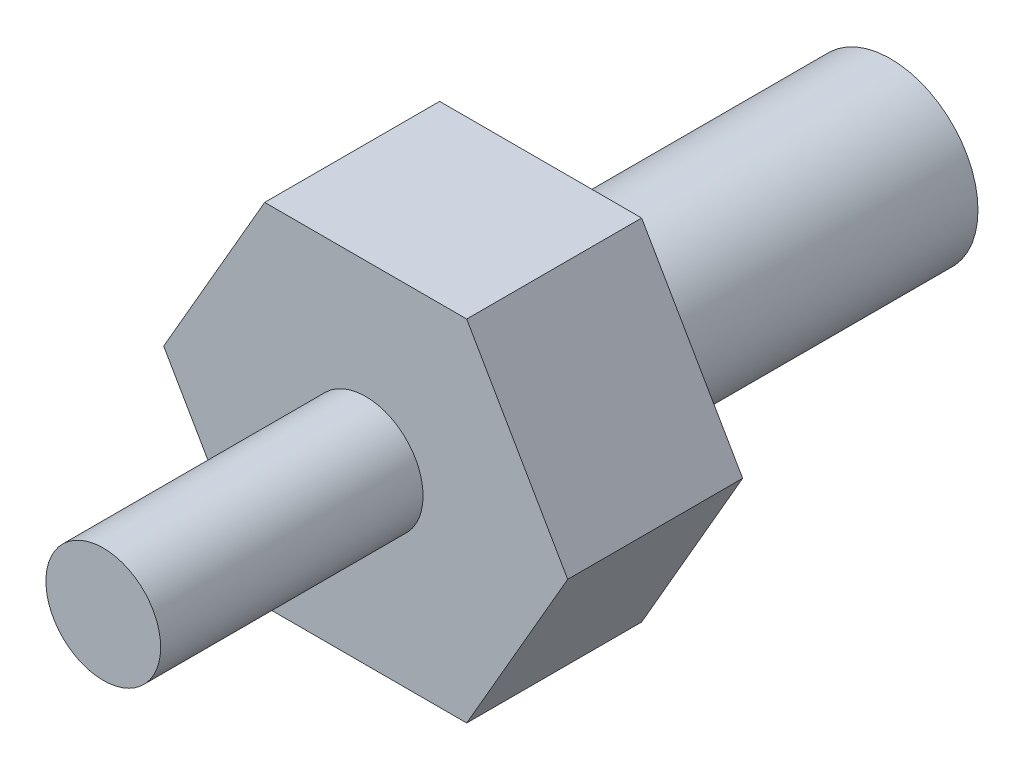
ISO-10303-21;
HEADER;
FILE_DESCRIPTION(('STEP AP214'),'2;1');
FILE_NAME('part.step','',(''),(''),'','','');
FILE_SCHEMA(('AUTOMOTIVE_DESIGN { 1 0 10303 214 1 1 1 1 }'));
ENDSEC;
DATA;
#1=APPLICATION_CONTEXT('core data for automotive mechanical design processes');
#2=APPLICATION_PROTOCOL_DEFINITION('international standard','automotive_design',2000,#1);
#3=PRODUCT_CONTEXT('',#1,'mechanical');
#4=PRODUCT('Part','Part','',(#3));
#5=PRODUCT_RELATED_PRODUCT_CATEGORY('part','',(#4));
#6=PRODUCT_DEFINITION_FORMATION('','',#4);
#7=PRODUCT_DEFINITION_CONTEXT('part definition',#1,'design');
#8=PRODUCT_DEFINITION('design','',#6,#7);
#9=PRODUCT_DEFINITION_SHAPE('','',#8);
#10=(LENGTH_UNIT() NAMED_UNIT(*) SI_UNIT(.MILLI.,.METRE.));
#11=(NAMED_UNIT(*) PLANE_ANGLE_UNIT() SI_UNIT($,.RADIAN.));
#12=(NAMED_UNIT(*) SI_UNIT($,.STERADIAN.) SOLID_ANGLE_UNIT());
#13=UNCERTAINTY_MEASURE_WITH_UNIT(LENGTH_MEASURE(1.E-05),#10,'distance_accuracy_value','');
#14=(GEOMETRIC_REPRESENTATION_CONTEXT(3) GLOBAL_UNCERTAINTY_ASSIGNED_CONTEXT((#13)) GLOBAL_UNIT_ASSIGNED_CONTEXT((#10,
#11,#12)) REPRESENTATION_CONTEXT('',''));
#15=CARTESIAN_POINT('',(0.,0.,0.));
#16=DIRECTION('',(0.,0.,1.));
#17=DIRECTION('',(1.,0.,0.));
#18=AXIS2_PLACEMENT_3D('',#15,#16,#17);
#19=CARTESIAN_POINT('',(0.,0.,12.7));
#20=DIRECTION('',(0.,0.,-1.));
#21=DIRECTION('',(-1.,0.,0.));
#22=AXIS2_PLACEMENT_3D('',#19,#20,#21);
#23=CYLINDRICAL_SURFACE('',#22,3.175);
#24=CARTESIAN_POINT('',(0.,0.,12.7));
#25=DIRECTION('',(0.,0.,1.));
#26=DIRECTION('',(1.,0.,0.));
#27=AXIS2_PLACEMENT_3D('',#24,#25,#26);
#28=CIRCLE('',#27,3.175);
#29=CARTESIAN_POINT('',(3.175,0.,12.7));
#30=VERTEX_POINT('',#29);
#31=EDGE_CURVE('E45',#30,#30,#28,.T.);
#32=ORIENTED_EDGE('',*,*,#31,.F.);
#33=EDGE_LOOP('',(#32));
#34=FACE_BOUND('',#33,.T.);
#35=CARTESIAN_POINT('',(0.,0.,0.));
#36=DIRECTION('',(0.,0.,1.));
#37=DIRECTION('',(1.,0.,0.));
#38=AXIS2_PLACEMENT_3D('',#35,#36,#37);
#39=CIRCLE('',#38,3.175);
#40=CARTESIAN_POINT('',(3.175,0.,0.));
#41=VERTEX_POINT('',#40);
#42=EDGE_CURVE('E39',#41,#41,#39,.T.);
#43=ORIENTED_EDGE('',*,*,#42,.T.);
#44=EDGE_LOOP('',(#43));
#45=FACE_BOUND('',#44,.T.);
#46=ADVANCED_FACE('F36',(#34,#45),#23,.T.);
#47=CARTESIAN_POINT('',(0.,0.,0.));
#48=DIRECTION('',(0.,0.,1.));
#49=DIRECTION('',(1.,0.,0.));
#50=AXIS2_PLACEMENT_3D('',#47,#48,#49);
#51=PLANE('',#50);
#52=ORIENTED_EDGE('',*,*,#42,.F.);
#53=EDGE_LOOP('',(#52));
#54=FACE_BOUND('',#53,.T.);
#55=ADVANCED_FACE('F149',(#54),#51,.F.);
#56=CARTESIAN_POINT('',(-3.66617420935412,-6.35,19.05));
#57=DIRECTION('',(0.,1.,0.));
#58=DIRECTION('',(0.,0.,1.));
#59=AXIS2_PLACEMENT_3D('',#56,#57,#58);
#60=PLANE('',#59);
#61=DIRECTION('',(1.,0.,0.));
#62=VECTOR('',#61,1.);
#63=CARTESIAN_POINT('',(-3.66617420935412,-6.35,12.7));
#64=LINE('',#63,#62);
#65=CARTESIAN_POINT('',(-3.66617420935412,-6.35,12.7));
#66=VERTEX_POINT('',#65);
#67=CARTESIAN_POINT('',(3.66617420935412,-6.35,12.7));
#68=VERTEX_POINT('',#67);
#69=EDGE_CURVE('E123',#66,#68,#64,.T.);
#70=ORIENTED_EDGE('',*,*,#69,.T.);
#71=DIRECTION('',(0.,0.,-1.));
#72=VECTOR('',#71,1.);
#73=CARTESIAN_POINT('',(3.66617420935412,-6.35,19.05));
#74=LINE('',#73,#72);
#75=CARTESIAN_POINT('',(3.66617420935412,-6.35,19.05));
#76=VERTEX_POINT('',#75);
#77=EDGE_CURVE('E141',#76,#68,#74,.T.);
#78=ORIENTED_EDGE('',*,*,#77,.F.);
#79=DIRECTION('',(1.,0.,0.));
#80=VECTOR('',#79,1.);
#81=CARTESIAN_POINT('',(-3.66617420935412,-6.35,19.05));
#82=LINE('',#81,#80);
#83=CARTESIAN_POINT('',(-3.66617420935412,-6.35,19.05));
#84=VERTEX_POINT('',#83);
#85=EDGE_CURVE('E134',#84,#76,#82,.T.);
#86=ORIENTED_EDGE('',*,*,#85,.F.);
#87=DIRECTION('',(0.,0.,-1.));
#88=VECTOR('',#87,1.);
#89=CARTESIAN_POINT('',(-3.66617420935412,-6.35,19.05));
#90=LINE('',#89,#88);
#91=EDGE_CURVE('E119',#84,#66,#90,.T.);
#92=ORIENTED_EDGE('',*,*,#91,.T.);
#93=EDGE_LOOP('',(#70,#78,#86,#92));
#94=FACE_BOUND('',#93,.T.);
#95=ADVANCED_FACE('F151',(#94),#60,.F.);
#96=CARTESIAN_POINT('',(3.66617420935412,-6.35,19.05));
#97=DIRECTION('',(-0.866025403784439,0.5,0.));
#98=DIRECTION('',(-0.5,-0.866025403784439,0.));
#99=AXIS2_PLACEMENT_3D('',#96,#97,#98);
#100=PLANE('',#99);
#101=DIRECTION('',(0.5,0.866025403784439,0.));
#102=VECTOR('',#101,1.);
#103=CARTESIAN_POINT('',(3.66617420935412,-6.35,12.7));
#104=LINE('',#103,#102);
#105=CARTESIAN_POINT('',(7.33234841870824,0.,12.7));
#106=VERTEX_POINT('',#105);
#107=EDGE_CURVE('E126',#68,#106,#104,.T.);
#108=ORIENTED_EDGE('',*,*,#107,.T.);
#109=DIRECTION('',(0.,0.,-1.));
#110=VECTOR('',#109,1.);
#111=CARTESIAN_POINT('',(7.33234841870824,0.,19.05));
#112=LINE('',#111,#110);
#113=CARTESIAN_POINT('',(7.33234841870824,0.,19.05));
#114=VERTEX_POINT('',#113);
#115=EDGE_CURVE('E138',#114,#106,#112,.T.);
#116=ORIENTED_EDGE('',*,*,#115,.F.);
#117=DIRECTION('',(0.5,0.866025403784439,0.));
#118=VECTOR('',#117,1.);
#119=CARTESIAN_POINT('',(3.66617420935412,-6.35,19.05));
#120=LINE('',#119,#118);
#121=EDGE_CURVE('E92',#76,#114,#120,.T.);
#122=ORIENTED_EDGE('',*,*,#121,.F.);
#123=ORIENTED_EDGE('',*,*,#77,.T.);
#124=EDGE_LOOP('',(#108,#116,#122,#123));
#125=FACE_BOUND('',#124,.T.);
#126=ADVANCED_FACE('F156',(#125),#100,.F.);
#127=CARTESIAN_POINT('',(7.33234841870824,0.,19.05));
#128=DIRECTION('',(-0.866025403784438,-0.5,0.));
#129=DIRECTION('',(0.5,-0.866025403784438,0.));
#130=AXIS2_PLACEMENT_3D('',#127,#128,#129);
#131=PLANE('',#130);
#132=DIRECTION('',(-0.5,0.866025403784438,0.));
#133=VECTOR('',#132,1.);
#134=CARTESIAN_POINT('',(7.33234841870824,0.,12.7));
#135=LINE('',#134,#133);
#136=CARTESIAN_POINT('',(3.66617420935412,6.35,12.7));
#137=VERTEX_POINT('',#136);
#138=EDGE_CURVE('E129',#106,#137,#135,.T.);
#139=ORIENTED_EDGE('',*,*,#138,.T.);
#140=DIRECTION('',(0.,0.,-1.));
#141=VECTOR('',#140,1.);
#142=CARTESIAN_POINT('',(3.66617420935412,6.35,19.05));
#143=LINE('',#142,#141);
#144=CARTESIAN_POINT('',(3.66617420935412,6.35,19.05));
#145=VERTEX_POINT('',#144);
#146=EDGE_CURVE('E114',#145,#137,#143,.T.);
#147=ORIENTED_EDGE('',*,*,#146,.F.);
#148=DIRECTION('',(-0.5,0.866025403784438,0.));
#149=VECTOR('',#148,1.);
#150=CARTESIAN_POINT('',(7.33234841870824,0.,19.05));
#151=LINE('',#150,#149);
#152=EDGE_CURVE('E105',#114,#145,#151,.T.);
#153=ORIENTED_EDGE('',*,*,#152,.F.);
#154=ORIENTED_EDGE('',*,*,#115,.T.);
#155=EDGE_LOOP('',(#139,#147,#153,#154));
#156=FACE_BOUND('',#155,.T.);
#157=ADVANCED_FACE('F163',(#156),#131,.F.);
#158=CARTESIAN_POINT('',(3.66617420935412,6.35,19.05));
#159=DIRECTION('',(0.,-1.,0.));
#160=DIRECTION('',(1.,0.,0.));
#161=AXIS2_PLACEMENT_3D('',#158,#159,#160);
#162=PLANE('',#161);
#163=DIRECTION('',(-1.,0.,0.));
#164=VECTOR('',#163,1.);
#165=CARTESIAN_POINT('',(3.66617420935412,6.35,12.7));
#166=LINE('',#165,#164);
#167=CARTESIAN_POINT('',(-3.66617420935412,6.35,12.7));
#168=VERTEX_POINT('',#167);
#169=EDGE_CURVE('E113',#137,#168,#166,.T.);
#170=ORIENTED_EDGE('',*,*,#169,.T.);
#171=DIRECTION('',(0.,0.,-1.));
#172=VECTOR('',#171,1.);
#173=CARTESIAN_POINT('',(-3.66617420935412,6.35,19.05));
#174=LINE('',#173,#172);
#175=CARTESIAN_POINT('',(-3.66617420935412,6.35,19.05));
#176=VERTEX_POINT('',#175);
#177=EDGE_CURVE('E110',#176,#168,#174,.T.);
#178=ORIENTED_EDGE('',*,*,#177,.F.);
#179=DIRECTION('',(-1.,0.,0.));
#180=VECTOR('',#179,1.);
#181=CARTESIAN_POINT('',(3.66617420935412,6.35,19.05));
#182=LINE('',#181,#180);
#183=EDGE_CURVE('E99',#145,#176,#182,.T.);
#184=ORIENTED_EDGE('',*,*,#183,.F.);
#185=ORIENTED_EDGE('',*,*,#146,.T.);
#186=EDGE_LOOP('',(#170,#178,#184,#185));
#187=FACE_BOUND('',#186,.T.);
#188=ADVANCED_FACE('F111',(#187),#162,.F.);
#189=CARTESIAN_POINT('',(-3.66617420935412,6.35,19.05));
#190=DIRECTION('',(0.866025403784438,-0.5,0.));
#191=DIRECTION('',(0.5,0.866025403784439,0.));
#192=AXIS2_PLACEMENT_3D('',#189,#190,#191);
#193=PLANE('',#192);
#194=DIRECTION('',(-0.5,-0.866025403784438,0.));
#195=VECTOR('',#194,1.);
#196=CARTESIAN_POINT('',(-3.66617420935412,6.35,12.7));
#197=LINE('',#196,#195);
#198=CARTESIAN_POINT('',(-7.33234841870825,0.,12.7));
#199=VERTEX_POINT('',#198);
#200=EDGE_CURVE('E77',#168,#199,#197,.T.);
#201=ORIENTED_EDGE('',*,*,#200,.T.);
#202=DIRECTION('',(0.,0.,-1.));
#203=VECTOR('',#202,1.);
#204=CARTESIAN_POINT('',(-7.33234841870825,0.,19.05));
#205=LINE('',#204,#203);
#206=CARTESIAN_POINT('',(-7.33234841870825,0.,19.05));
#207=VERTEX_POINT('',#206);
#208=EDGE_CURVE('E115',#207,#199,#205,.T.);
#209=ORIENTED_EDGE('',*,*,#208,.F.);
#210=DIRECTION('',(-0.5,-0.866025403784438,0.));
#211=VECTOR('',#210,1.);
#212=CARTESIAN_POINT('',(-3.66617420935412,6.35,19.05));
#213=LINE('',#212,#211);
#214=EDGE_CURVE('E103',#176,#207,#213,.T.);
#215=ORIENTED_EDGE('',*,*,#214,.F.);
#216=ORIENTED_EDGE('',*,*,#177,.T.);
#217=EDGE_LOOP('',(#201,#209,#215,#216));
#218=FACE_BOUND('',#217,.T.);
#219=ADVANCED_FACE('F117',(#218),#193,.F.);
#220=CARTESIAN_POINT('',(-7.33234841870825,0.,19.05));
#221=DIRECTION('',(0.866025403784438,0.5,0.));
#222=DIRECTION('',(-0.5,0.866025403784438,0.));
#223=AXIS2_PLACEMENT_3D('',#220,#221,#222);
#224=PLANE('',#223);
#225=DIRECTION('',(0.5,-0.866025403784438,0.));
#226=VECTOR('',#225,1.);
#227=CARTESIAN_POINT('',(-7.33234841870825,0.,12.7));
#228=LINE('',#227,#226);
#229=EDGE_CURVE('E83',#199,#66,#228,.T.);
#230=ORIENTED_EDGE('',*,*,#229,.T.);
#231=ORIENTED_EDGE('',*,*,#91,.F.);
#232=DIRECTION('',(0.5,-0.866025403784438,0.));
#233=VECTOR('',#232,1.);
#234=CARTESIAN_POINT('',(-7.33234841870825,0.,19.05));
#235=LINE('',#234,#233);
#236=EDGE_CURVE('E54',#207,#84,#235,.T.);
#237=ORIENTED_EDGE('',*,*,#236,.F.);
#238=ORIENTED_EDGE('',*,*,#208,.T.);
#239=EDGE_LOOP('',(#230,#231,#237,#238));
#240=FACE_BOUND('',#239,.T.);
#241=ADVANCED_FACE('F171',(#240),#224,.F.);
#242=CARTESIAN_POINT('',(0.,0.,19.05));
#243=DIRECTION('',(0.,0.,1.));
#244=DIRECTION('',(1.,0.,0.));
#245=AXIS2_PLACEMENT_3D('',#242,#243,#244);
#246=PLANE('',#245);
#247=CARTESIAN_POINT('',(0.,0.,19.05));
#248=DIRECTION('',(0.,0.,1.));
#249=DIRECTION('',(1.,0.,0.));
#250=AXIS2_PLACEMENT_3D('',#247,#248,#249);
#251=CIRCLE('',#250,2.0828);
#252=CARTESIAN_POINT('',(2.0828,0.,19.05));
#253=VERTEX_POINT('',#252);
#254=EDGE_CURVE('E11',#253,#253,#251,.T.);
#255=ORIENTED_EDGE('',*,*,#254,.F.);
#256=EDGE_LOOP('',(#255));
#257=FACE_BOUND('',#256,.T.);
#258=ORIENTED_EDGE('',*,*,#85,.T.);
#259=ORIENTED_EDGE('',*,*,#121,.T.);
#260=ORIENTED_EDGE('',*,*,#152,.T.);
#261=ORIENTED_EDGE('',*,*,#183,.T.);
#262=ORIENTED_EDGE('',*,*,#214,.T.);
#263=ORIENTED_EDGE('',*,*,#236,.T.);
#264=EDGE_LOOP('',(#258,#259,#260,#261,#262,#263));
#265=FACE_BOUND('',#264,.T.);
#266=ADVANCED_FACE('F101',(#257,#265),#246,.T.);
#267=CARTESIAN_POINT('',(0.,0.,12.7));
#268=DIRECTION('',(0.,0.,1.));
#269=DIRECTION('',(1.,0.,0.));
#270=AXIS2_PLACEMENT_3D('',#267,#268,#269);
#271=PLANE('',#270);
#272=ORIENTED_EDGE('',*,*,#31,.T.);
#273=EDGE_LOOP('',(#272));
#274=FACE_BOUND('',#273,.T.);
#275=ORIENTED_EDGE('',*,*,#69,.F.);
#276=ORIENTED_EDGE('',*,*,#229,.F.);
#277=ORIENTED_EDGE('',*,*,#200,.F.);
#278=ORIENTED_EDGE('',*,*,#169,.F.);
#279=ORIENTED_EDGE('',*,*,#138,.F.);
#280=ORIENTED_EDGE('',*,*,#107,.F.);
#281=EDGE_LOOP('',(#275,#276,#277,#278,#279,#280));
#282=FACE_BOUND('',#281,.T.);
#283=ADVANCED_FACE('F174',(#274,#282),#271,.F.);
#284=CARTESIAN_POINT('',(0.,0.,28.575));
#285=DIRECTION('',(0.,0.,-1.));
#286=DIRECTION('',(-1.,0.,0.));
#287=AXIS2_PLACEMENT_3D('',#284,#285,#286);
#288=CYLINDRICAL_SURFACE('',#287,2.0828);
#289=CARTESIAN_POINT('',(0.,0.,28.575));
#290=DIRECTION('',(0.,0.,1.));
#291=DIRECTION('',(1.,0.,0.));
#292=AXIS2_PLACEMENT_3D('',#289,#290,#291);
#293=CIRCLE('',#292,2.0828);
#294=CARTESIAN_POINT('',(2.0828,0.,28.575));
#295=VERTEX_POINT('',#294);
#296=EDGE_CURVE('E127',#295,#295,#293,.T.);
#297=ORIENTED_EDGE('',*,*,#296,.F.);
#298=EDGE_LOOP('',(#297));
#299=FACE_BOUND('',#298,.T.);
#300=ORIENTED_EDGE('',*,*,#254,.T.);
#301=EDGE_LOOP('',(#300));
#302=FACE_BOUND('',#301,.T.);
#303=ADVANCED_FACE('F177',(#299,#302),#288,.T.);
#304=CARTESIAN_POINT('',(0.,0.,28.575));
#305=DIRECTION('',(0.,0.,1.));
#306=DIRECTION('',(1.,0.,0.));
#307=AXIS2_PLACEMENT_3D('',#304,#305,#306);
#308=PLANE('',#307);
#309=ORIENTED_EDGE('',*,*,#296,.T.);
#310=EDGE_LOOP('',(#309));
#311=FACE_BOUND('',#310,.T.);
#312=ADVANCED_FACE('F183',(#311),#308,.T.);
#313=CLOSED_SHELL('',(#46,#55,#95,#126,#157,#188,#219,#241,#266,#283,#303,#312));
#314=MANIFOLD_SOLID_BREP('B2',#313);
#315=ADVANCED_BREP_SHAPE_REPRESENTATION('',(#18,#314),#14);
#316=SHAPE_DEFINITION_REPRESENTATION(#9,#315);
ENDSEC;
END-ISO-10303-21;
